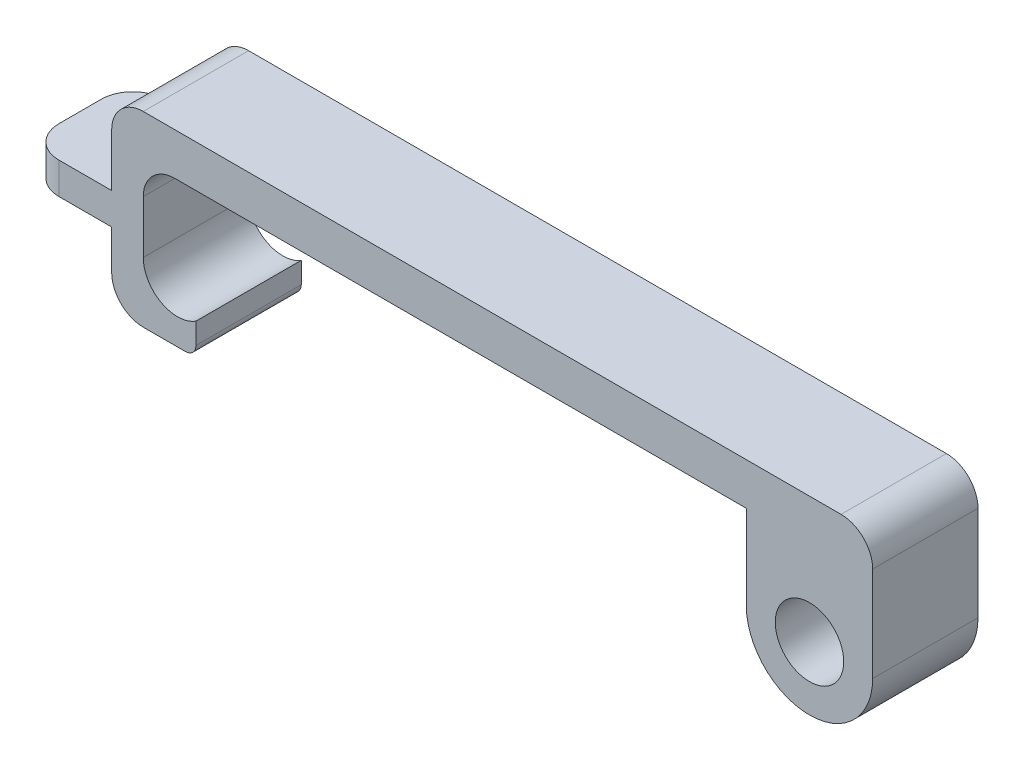
ISO-10303-21;
HEADER;
FILE_DESCRIPTION(('STEP AP214'),'2;1');
FILE_NAME('part.step','',(''),(''),'','','');
FILE_SCHEMA(('AUTOMOTIVE_DESIGN { 1 0 10303 214 1 1 1 1 }'));
ENDSEC;
DATA;
#1=APPLICATION_CONTEXT('core data for automotive mechanical design processes');
#2=APPLICATION_PROTOCOL_DEFINITION('international standard','automotive_design',2000,#1);
#3=PRODUCT_CONTEXT('',#1,'mechanical');
#4=PRODUCT('Part','Part','',(#3));
#5=PRODUCT_RELATED_PRODUCT_CATEGORY('part','',(#4));
#6=PRODUCT_DEFINITION_FORMATION('','',#4);
#7=PRODUCT_DEFINITION_CONTEXT('part definition',#1,'design');
#8=PRODUCT_DEFINITION('design','',#6,#7);
#9=PRODUCT_DEFINITION_SHAPE('','',#8);
#10=(LENGTH_UNIT() NAMED_UNIT(*) SI_UNIT(.MILLI.,.METRE.));
#11=(NAMED_UNIT(*) PLANE_ANGLE_UNIT() SI_UNIT($,.RADIAN.));
#12=(NAMED_UNIT(*) SI_UNIT($,.STERADIAN.) SOLID_ANGLE_UNIT());
#13=UNCERTAINTY_MEASURE_WITH_UNIT(LENGTH_MEASURE(1.E-05),#10,'distance_accuracy_value','');
#14=(GEOMETRIC_REPRESENTATION_CONTEXT(3) GLOBAL_UNCERTAINTY_ASSIGNED_CONTEXT((#13)) GLOBAL_UNIT_ASSIGNED_CONTEXT((#10,
#11,#12)) REPRESENTATION_CONTEXT('',''));
#15=CARTESIAN_POINT('',(0.,0.,0.));
#16=DIRECTION('',(0.,0.,1.));
#17=DIRECTION('',(1.,0.,0.));
#18=AXIS2_PLACEMENT_3D('',#15,#16,#17);
#19=CARTESIAN_POINT('',(-42.4115968956036,18.9102108321819,10.));
#20=DIRECTION('',(0.,0.,1.));
#21=DIRECTION('',(1.,0.,0.));
#22=AXIS2_PLACEMENT_3D('',#19,#20,#21);
#23=PLANE('',#22);
#24=DIRECTION('',(1.,0.,0.));
#25=VECTOR('',#24,1.);
#26=CARTESIAN_POINT('',(-40.6615968956036,13.1715980446561,10.));
#27=LINE('',#26,#25);
#28=CARTESIAN_POINT('',(-45.6615968956036,13.1715980446561,10.));
#29=VERTEX_POINT('',#28);
#30=CARTESIAN_POINT('',(-41.6615968956036,13.1715980446561,10.));
#31=VERTEX_POINT('',#30);
#32=EDGE_CURVE('E207',#29,#31,#27,.T.);
#33=ORIENTED_EDGE('',*,*,#32,.T.);
#34=CARTESIAN_POINT('',(-41.6615968956036,14.1715980446561,10.));
#35=DIRECTION('',(0.,0.,1.));
#36=DIRECTION('',(1.,0.,0.));
#37=AXIS2_PLACEMENT_3D('',#34,#35,#36);
#38=CIRCLE('',#37,1.);
#39=CARTESIAN_POINT('',(-40.6615968956036,14.1715980446561,10.));
#40=VERTEX_POINT('',#39);
#41=EDGE_CURVE('E11',#31,#40,#38,.T.);
#42=ORIENTED_EDGE('',*,*,#41,.T.);
#43=DIRECTION('',(0.,1.,0.));
#44=VECTOR('',#43,1.);
#45=CARTESIAN_POINT('',(-40.6615968956036,16.1715980446561,10.));
#46=LINE('',#45,#44);
#47=CARTESIAN_POINT('',(-40.6615968956036,16.1715980446561,10.));
#48=VERTEX_POINT('',#47);
#49=EDGE_CURVE('E209',#40,#48,#46,.T.);
#50=ORIENTED_EDGE('',*,*,#49,.T.);
#51=CARTESIAN_POINT('',(-42.4115968956036,18.9102108321819,10.));
#52=DIRECTION('',(0.,0.,-1.));
#53=DIRECTION('',(1.,0.,0.));
#54=AXIS2_PLACEMENT_3D('',#51,#52,#53);
#55=CIRCLE('',#54,3.25);
#56=CARTESIAN_POINT('',(-45.6615968956036,18.9102108321819,10.));
#57=VERTEX_POINT('',#56);
#58=EDGE_CURVE('E214',#48,#57,#55,.T.);
#59=ORIENTED_EDGE('',*,*,#58,.T.);
#60=DIRECTION('',(0.,1.,0.));
#61=VECTOR('',#60,1.);
#62=CARTESIAN_POINT('',(-45.6615968956036,26.9102108321804,10.));
#63=LINE('',#62,#61);
#64=CARTESIAN_POINT('',(-45.6615968956036,23.9102108321804,10.));
#65=VERTEX_POINT('',#64);
#66=EDGE_CURVE('E216',#57,#65,#63,.T.);
#67=ORIENTED_EDGE('',*,*,#66,.T.);
#68=CARTESIAN_POINT('',(-42.6615968956036,23.9102108321804,10.));
#69=DIRECTION('',(0.,0.,1.));
#70=DIRECTION('',(1.,0.,0.));
#71=AXIS2_PLACEMENT_3D('',#68,#69,#70);
#72=CIRCLE('',#71,3.);
#73=CARTESIAN_POINT('',(-42.6615968956036,26.9102108321804,10.));
#74=VERTEX_POINT('',#73);
#75=EDGE_CURVE('E334',#65,#74,#72,.F.);
#76=ORIENTED_EDGE('',*,*,#75,.T.);
#77=DIRECTION('',(1.,0.,0.));
#78=VECTOR('',#77,1.);
#79=CARTESIAN_POINT('',(11.5884031043968,26.9102108321804,10.));
#80=LINE('',#79,#78);
#81=CARTESIAN_POINT('',(11.5884031043968,26.9102108321804,10.));
#82=VERTEX_POINT('',#81);
#83=EDGE_CURVE('E219',#74,#82,#80,.T.);
#84=ORIENTED_EDGE('',*,*,#83,.T.);
#85=DIRECTION('',(0.,-1.,0.));
#86=VECTOR('',#85,1.);
#87=CARTESIAN_POINT('',(11.5884031043968,18.9102108321817,10.));
#88=LINE('',#87,#86);
#89=CARTESIAN_POINT('',(11.5884031043968,18.9102108321817,10.));
#90=VERTEX_POINT('',#89);
#91=EDGE_CURVE('E221',#82,#90,#88,.T.);
#92=ORIENTED_EDGE('',*,*,#91,.T.);
#93=CARTESIAN_POINT('',(17.5884031043968,18.9102108321817,10.));
#94=DIRECTION('',(0.,0.,1.));
#95=DIRECTION('',(1.,0.,0.));
#96=AXIS2_PLACEMENT_3D('',#93,#94,#95);
#97=CIRCLE('',#96,6.);
#98=CARTESIAN_POINT('',(23.5884031043968,18.9102108321817,10.));
#99=VERTEX_POINT('',#98);
#100=EDGE_CURVE('E223',#90,#99,#97,.T.);
#101=ORIENTED_EDGE('',*,*,#100,.T.);
#102=DIRECTION('',(0.,1.,0.));
#103=VECTOR('',#102,1.);
#104=CARTESIAN_POINT('',(23.5884031043968,30.9102108321804,10.));
#105=LINE('',#104,#103);
#106=CARTESIAN_POINT('',(23.5884031043968,27.9102108321804,10.));
#107=VERTEX_POINT('',#106);
#108=EDGE_CURVE('E225',#99,#107,#105,.T.);
#109=ORIENTED_EDGE('',*,*,#108,.T.);
#110=CARTESIAN_POINT('',(20.5884031043968,27.9102108321804,10.));
#111=DIRECTION('',(0.,0.,1.));
#112=DIRECTION('',(1.,0.,0.));
#113=AXIS2_PLACEMENT_3D('',#110,#111,#112);
#114=CIRCLE('',#113,3.);
#115=CARTESIAN_POINT('',(20.5884031043968,30.9102108321804,10.));
#116=VERTEX_POINT('',#115);
#117=EDGE_CURVE('E285',#107,#116,#114,.T.);
#118=ORIENTED_EDGE('',*,*,#117,.T.);
#119=DIRECTION('',(-1.,0.,0.));
#120=VECTOR('',#119,1.);
#121=CARTESIAN_POINT('',(-48.6615968956036,30.9102108321804,10.));
#122=LINE('',#121,#120);
#123=CARTESIAN_POINT('',(-45.6615968956036,30.9102108321804,10.));
#124=VERTEX_POINT('',#123);
#125=EDGE_CURVE('E228',#116,#124,#122,.T.);
#126=ORIENTED_EDGE('',*,*,#125,.T.);
#127=CARTESIAN_POINT('',(-45.6615968956036,27.9102108321804,10.));
#128=DIRECTION('',(0.,0.,1.));
#129=DIRECTION('',(1.,0.,0.));
#130=AXIS2_PLACEMENT_3D('',#127,#128,#129);
#131=CIRCLE('',#130,3.);
#132=CARTESIAN_POINT('',(-48.6615968956036,27.9102108321804,10.));
#133=VERTEX_POINT('',#132);
#134=EDGE_CURVE('E289',#124,#133,#131,.T.);
#135=ORIENTED_EDGE('',*,*,#134,.T.);
#136=DIRECTION('',(0.,-1.,0.));
#137=VECTOR('',#136,1.);
#138=CARTESIAN_POINT('',(-48.6615968956036,22.9102108321804,10.));
#139=LINE('',#138,#137);
#140=CARTESIAN_POINT('',(-48.6615968956036,22.9102108321804,10.));
#141=VERTEX_POINT('',#140);
#142=EDGE_CURVE('E231',#133,#141,#139,.T.);
#143=ORIENTED_EDGE('',*,*,#142,.T.);
#144=DIRECTION('',(-1.,0.,0.));
#145=VECTOR('',#144,1.);
#146=CARTESIAN_POINT('',(-48.6615968956036,22.9102108321804,10.));
#147=LINE('',#146,#145);
#148=CARTESIAN_POINT('',(-53.6615968956036,22.9102108321804,10.));
#149=VERTEX_POINT('',#148);
#150=EDGE_CURVE('E191',#141,#149,#147,.T.);
#151=ORIENTED_EDGE('',*,*,#150,.T.);
#152=DIRECTION('',(0.,-1.,0.));
#153=VECTOR('',#152,1.);
#154=CARTESIAN_POINT('',(-53.6615968956036,19.9102108321804,10.));
#155=LINE('',#154,#153);
#156=CARTESIAN_POINT('',(-53.6615968956036,19.9102108321804,10.));
#157=VERTEX_POINT('',#156);
#158=EDGE_CURVE('E189',#149,#157,#155,.T.);
#159=ORIENTED_EDGE('',*,*,#158,.T.);
#160=DIRECTION('',(1.,0.,0.));
#161=VECTOR('',#160,1.);
#162=CARTESIAN_POINT('',(-48.6615968956036,19.9102108321804,10.));
#163=LINE('',#162,#161);
#164=CARTESIAN_POINT('',(-48.6615968956036,19.9102108321804,10.));
#165=VERTEX_POINT('',#164);
#166=EDGE_CURVE('E181',#157,#165,#163,.T.);
#167=ORIENTED_EDGE('',*,*,#166,.T.);
#168=DIRECTION('',(0.,-1.,0.));
#169=VECTOR('',#168,1.);
#170=CARTESIAN_POINT('',(-48.6615968956036,13.1715980446561,10.));
#171=LINE('',#170,#169);
#172=CARTESIAN_POINT('',(-48.6615968956036,16.1715980446561,10.));
#173=VERTEX_POINT('',#172);
#174=EDGE_CURVE('E185',#165,#173,#171,.T.);
#175=ORIENTED_EDGE('',*,*,#174,.T.);
#176=CARTESIAN_POINT('',(-45.6615968956036,16.1715980446561,10.));
#177=DIRECTION('',(0.,0.,1.));
#178=DIRECTION('',(1.,0.,0.));
#179=AXIS2_PLACEMENT_3D('',#176,#177,#178);
#180=CIRCLE('',#179,3.);
#181=EDGE_CURVE('E287',#173,#29,#180,.T.);
#182=ORIENTED_EDGE('',*,*,#181,.T.);
#183=EDGE_LOOP('',(#33,#42,#50,#59,#67,#76,#84,#92,#101,#109,#118,#126,#135,#143,#151,#159,#167,
#175,#182));
#184=FACE_BOUND('',#183,.T.);
#185=CARTESIAN_POINT('',(17.5884031043968,18.9102108321817,10.));
#186=DIRECTION('',(0.,0.,1.));
#187=DIRECTION('',(1.,0.,0.));
#188=AXIS2_PLACEMENT_3D('',#185,#186,#187);
#189=CIRCLE('',#188,3.25);
#190=CARTESIAN_POINT('',(20.8384031043968,18.9102108321817,10.));
#191=VERTEX_POINT('',#190);
#192=EDGE_CURVE('E237',#191,#191,#189,.T.);
#193=ORIENTED_EDGE('',*,*,#192,.F.);
#194=EDGE_LOOP('',(#193));
#195=FACE_BOUND('',#194,.T.);
#196=ADVANCED_FACE('F37',(#184,#195),#23,.T.);
#197=CARTESIAN_POINT('',(-42.4115968956036,18.9102108321819,0.));
#198=DIRECTION('',(0.,0.,1.));
#199=DIRECTION('',(1.,0.,0.));
#200=AXIS2_PLACEMENT_3D('',#197,#198,#199);
#201=PLANE('',#200);
#202=DIRECTION('',(0.,1.,0.));
#203=VECTOR('',#202,1.);
#204=CARTESIAN_POINT('',(-40.6615968956036,16.1715980446561,0.));
#205=LINE('',#204,#203);
#206=CARTESIAN_POINT('',(-40.6615968956036,14.1715980446561,0.));
#207=VERTEX_POINT('',#206);
#208=CARTESIAN_POINT('',(-40.6615968956036,16.1715980446561,0.));
#209=VERTEX_POINT('',#208);
#210=EDGE_CURVE('E243',#207,#209,#205,.T.);
#211=ORIENTED_EDGE('',*,*,#210,.F.);
#212=CARTESIAN_POINT('',(-41.6615968956036,14.1715980446561,0.));
#213=DIRECTION('',(0.,0.,1.));
#214=DIRECTION('',(1.,0.,0.));
#215=AXIS2_PLACEMENT_3D('',#212,#213,#214);
#216=CIRCLE('',#215,1.);
#217=CARTESIAN_POINT('',(-41.6615968956036,13.1715980446561,0.));
#218=VERTEX_POINT('',#217);
#219=EDGE_CURVE('E59',#207,#218,#216,.F.);
#220=ORIENTED_EDGE('',*,*,#219,.T.);
#221=DIRECTION('',(1.,0.,0.));
#222=VECTOR('',#221,1.);
#223=CARTESIAN_POINT('',(-40.6615968956036,13.1715980446561,0.));
#224=LINE('',#223,#222);
#225=CARTESIAN_POINT('',(-45.6615968956036,13.1715980446561,0.));
#226=VERTEX_POINT('',#225);
#227=EDGE_CURVE('E241',#226,#218,#224,.T.);
#228=ORIENTED_EDGE('',*,*,#227,.F.);
#229=CARTESIAN_POINT('',(-45.6615968956036,16.1715980446561,0.));
#230=DIRECTION('',(0.,0.,1.));
#231=DIRECTION('',(1.,0.,0.));
#232=AXIS2_PLACEMENT_3D('',#229,#230,#231);
#233=CIRCLE('',#232,3.);
#234=CARTESIAN_POINT('',(-48.6615968956036,16.1715980446561,0.));
#235=VERTEX_POINT('',#234);
#236=EDGE_CURVE('E307',#226,#235,#233,.F.);
#237=ORIENTED_EDGE('',*,*,#236,.T.);
#238=DIRECTION('',(0.,-1.,0.));
#239=VECTOR('',#238,1.);
#240=CARTESIAN_POINT('',(-48.6615968956036,13.1715980446561,0.));
#241=LINE('',#240,#239);
#242=CARTESIAN_POINT('',(-48.6615968956036,19.9102108321804,0.));
#243=VERTEX_POINT('',#242);
#244=EDGE_CURVE('E239',#243,#235,#241,.T.);
#245=ORIENTED_EDGE('',*,*,#244,.F.);
#246=DIRECTION('',(1.,0.,0.));
#247=VECTOR('',#246,1.);
#248=CARTESIAN_POINT('',(-48.6615968956036,19.9102108321804,0.));
#249=LINE('',#248,#247);
#250=CARTESIAN_POINT('',(-53.6615968956036,19.9102108321804,0.));
#251=VERTEX_POINT('',#250);
#252=EDGE_CURVE('E197',#251,#243,#249,.T.);
#253=ORIENTED_EDGE('',*,*,#252,.F.);
#254=DIRECTION('',(0.,-1.,0.));
#255=VECTOR('',#254,1.);
#256=CARTESIAN_POINT('',(-53.6615968956036,18.910210832182,0.));
#257=LINE('',#256,#255);
#258=CARTESIAN_POINT('',(-53.6615968956036,22.9102108321804,0.));
#259=VERTEX_POINT('',#258);
#260=EDGE_CURVE('E311',#251,#259,#257,.F.);
#261=ORIENTED_EDGE('',*,*,#260,.T.);
#262=DIRECTION('',(-1.,0.,0.));
#263=VECTOR('',#262,1.);
#264=CARTESIAN_POINT('',(-48.6615968956036,22.9102108321804,0.));
#265=LINE('',#264,#263);
#266=CARTESIAN_POINT('',(-48.6615968956036,22.9102108321804,0.));
#267=VERTEX_POINT('',#266);
#268=EDGE_CURVE('E234',#267,#259,#265,.T.);
#269=ORIENTED_EDGE('',*,*,#268,.F.);
#270=DIRECTION('',(0.,-1.,0.));
#271=VECTOR('',#270,1.);
#272=CARTESIAN_POINT('',(-48.6615968956036,22.9102108321804,0.));
#273=LINE('',#272,#271);
#274=CARTESIAN_POINT('',(-48.6615968956036,27.9102108321804,0.));
#275=VERTEX_POINT('',#274);
#276=EDGE_CURVE('E262',#275,#267,#273,.T.);
#277=ORIENTED_EDGE('',*,*,#276,.F.);
#278=CARTESIAN_POINT('',(-45.6615968956036,27.9102108321804,0.));
#279=DIRECTION('',(0.,0.,1.));
#280=DIRECTION('',(1.,0.,0.));
#281=AXIS2_PLACEMENT_3D('',#278,#279,#280);
#282=CIRCLE('',#281,3.);
#283=CARTESIAN_POINT('',(-45.6615968956036,30.9102108321804,0.));
#284=VERTEX_POINT('',#283);
#285=EDGE_CURVE('E309',#275,#284,#282,.F.);
#286=ORIENTED_EDGE('',*,*,#285,.T.);
#287=DIRECTION('',(-1.,0.,0.));
#288=VECTOR('',#287,1.);
#289=CARTESIAN_POINT('',(-48.6615968956036,30.9102108321804,0.));
#290=LINE('',#289,#288);
#291=CARTESIAN_POINT('',(20.5884031043968,30.9102108321804,0.));
#292=VERTEX_POINT('',#291);
#293=EDGE_CURVE('E259',#292,#284,#290,.T.);
#294=ORIENTED_EDGE('',*,*,#293,.F.);
#295=CARTESIAN_POINT('',(20.5884031043968,27.9102108321804,0.));
#296=DIRECTION('',(0.,0.,1.));
#297=DIRECTION('',(1.,0.,0.));
#298=AXIS2_PLACEMENT_3D('',#295,#296,#297);
#299=CIRCLE('',#298,3.);
#300=CARTESIAN_POINT('',(23.5884031043968,27.9102108321804,0.));
#301=VERTEX_POINT('',#300);
#302=EDGE_CURVE('E305',#292,#301,#299,.F.);
#303=ORIENTED_EDGE('',*,*,#302,.T.);
#304=DIRECTION('',(0.,1.,0.));
#305=VECTOR('',#304,1.);
#306=CARTESIAN_POINT('',(23.5884031043968,30.9102108321804,0.));
#307=LINE('',#306,#305);
#308=CARTESIAN_POINT('',(23.5884031043968,18.9102108321817,0.));
#309=VERTEX_POINT('',#308);
#310=EDGE_CURVE('E256',#309,#301,#307,.T.);
#311=ORIENTED_EDGE('',*,*,#310,.F.);
#312=CARTESIAN_POINT('',(17.5884031043968,18.9102108321817,0.));
#313=DIRECTION('',(0.,0.,1.));
#314=DIRECTION('',(1.,0.,0.));
#315=AXIS2_PLACEMENT_3D('',#312,#313,#314);
#316=CIRCLE('',#315,6.);
#317=CARTESIAN_POINT('',(11.5884031043968,18.9102108321817,0.));
#318=VERTEX_POINT('',#317);
#319=EDGE_CURVE('E254',#318,#309,#316,.T.);
#320=ORIENTED_EDGE('',*,*,#319,.F.);
#321=DIRECTION('',(0.,-1.,0.));
#322=VECTOR('',#321,1.);
#323=CARTESIAN_POINT('',(11.5884031043968,18.9102108321817,0.));
#324=LINE('',#323,#322);
#325=CARTESIAN_POINT('',(11.5884031043968,26.9102108321804,0.));
#326=VERTEX_POINT('',#325);
#327=EDGE_CURVE('E252',#326,#318,#324,.T.);
#328=ORIENTED_EDGE('',*,*,#327,.F.);
#329=DIRECTION('',(1.,0.,0.));
#330=VECTOR('',#329,1.);
#331=CARTESIAN_POINT('',(11.5884031043968,26.9102108321804,0.));
#332=LINE('',#331,#330);
#333=CARTESIAN_POINT('',(-42.6615968956036,26.9102108321804,0.));
#334=VERTEX_POINT('',#333);
#335=EDGE_CURVE('E250',#334,#326,#332,.T.);
#336=ORIENTED_EDGE('',*,*,#335,.F.);
#337=CARTESIAN_POINT('',(-42.6615968956036,23.9102108321804,0.));
#338=DIRECTION('',(0.,0.,1.));
#339=DIRECTION('',(1.,0.,0.));
#340=AXIS2_PLACEMENT_3D('',#337,#338,#339);
#341=CIRCLE('',#340,3.);
#342=CARTESIAN_POINT('',(-45.6615968956036,23.9102108321804,0.));
#343=VERTEX_POINT('',#342);
#344=EDGE_CURVE('E332',#334,#343,#341,.T.);
#345=ORIENTED_EDGE('',*,*,#344,.T.);
#346=DIRECTION('',(0.,1.,0.));
#347=VECTOR('',#346,1.);
#348=CARTESIAN_POINT('',(-45.6615968956036,26.9102108321804,0.));
#349=LINE('',#348,#347);
#350=CARTESIAN_POINT('',(-45.6615968956036,18.9102108321819,0.));
#351=VERTEX_POINT('',#350);
#352=EDGE_CURVE('E247',#351,#343,#349,.T.);
#353=ORIENTED_EDGE('',*,*,#352,.F.);
#354=CARTESIAN_POINT('',(-42.4115968956036,18.9102108321819,0.));
#355=DIRECTION('',(0.,0.,-1.));
#356=DIRECTION('',(1.,0.,0.));
#357=AXIS2_PLACEMENT_3D('',#354,#355,#356);
#358=CIRCLE('',#357,3.25);
#359=EDGE_CURVE('E245',#209,#351,#358,.T.);
#360=ORIENTED_EDGE('',*,*,#359,.F.);
#361=EDGE_LOOP('',(#211,#220,#228,#237,#245,#253,#261,#269,#277,#286,#294,#303,#311,#320,#328,
#336,#345,#353,#360));
#362=FACE_BOUND('',#361,.T.);
#363=CARTESIAN_POINT('',(17.5884031043968,18.9102108321817,0.));
#364=DIRECTION('',(0.,0.,1.));
#365=DIRECTION('',(1.,0.,0.));
#366=AXIS2_PLACEMENT_3D('',#363,#364,#365);
#367=CIRCLE('',#366,3.25);
#368=CARTESIAN_POINT('',(20.8384031043968,18.9102108321817,0.));
#369=VERTEX_POINT('',#368);
#370=EDGE_CURVE('E666',#369,#369,#367,.T.);
#371=ORIENTED_EDGE('',*,*,#370,.T.);
#372=EDGE_LOOP('',(#371));
#373=FACE_BOUND('',#372,.T.);
#374=ADVANCED_FACE('F347',(#362,#373),#201,.F.);
#375=CARTESIAN_POINT('',(-48.6615968956036,22.9102108321804,10.));
#376=DIRECTION('',(0.,-1.,0.));
#377=DIRECTION('',(0.,0.,-1.));
#378=AXIS2_PLACEMENT_3D('',#375,#376,#377);
#379=PLANE('',#378);
#380=DIRECTION('',(0.,0.,-1.));
#381=VECTOR('',#380,1.);
#382=CARTESIAN_POINT('',(-56.6615968956036,22.9102108321804,10.));
#383=LINE('',#382,#381);
#384=CARTESIAN_POINT('',(-56.6615968956036,22.9102108321804,7.));
#385=VERTEX_POINT('',#384);
#386=CARTESIAN_POINT('',(-56.6615968956036,22.9102108321804,3.));
#387=VERTEX_POINT('',#386);
#388=EDGE_CURVE('E282',#385,#387,#383,.T.);
#389=ORIENTED_EDGE('',*,*,#388,.F.);
#390=CARTESIAN_POINT('',(-53.6615968956036,22.9102108321804,7.));
#391=DIRECTION('',(0.,-1.,0.));
#392=DIRECTION('',(0.,0.,-1.));
#393=AXIS2_PLACEMENT_3D('',#390,#391,#392);
#394=CIRCLE('',#393,3.);
#395=EDGE_CURVE('E303',#385,#149,#394,.F.);
#396=ORIENTED_EDGE('',*,*,#395,.T.);
#397=ORIENTED_EDGE('',*,*,#150,.F.);
#398=DIRECTION('',(0.,0.,-1.));
#399=VECTOR('',#398,1.);
#400=CARTESIAN_POINT('',(-48.6615968956036,22.9102108321804,10.));
#401=LINE('',#400,#399);
#402=EDGE_CURVE('E233',#141,#267,#401,.T.);
#403=ORIENTED_EDGE('',*,*,#402,.T.);
#404=ORIENTED_EDGE('',*,*,#268,.T.);
#405=CARTESIAN_POINT('',(-53.6615968956036,22.9102108321804,3.));
#406=DIRECTION('',(0.,-1.,0.));
#407=DIRECTION('',(0.,0.,-1.));
#408=AXIS2_PLACEMENT_3D('',#405,#406,#407);
#409=CIRCLE('',#408,3.);
#410=EDGE_CURVE('E301',#259,#387,#409,.F.);
#411=ORIENTED_EDGE('',*,*,#410,.T.);
#412=EDGE_LOOP('',(#389,#396,#397,#403,#404,#411));
#413=FACE_BOUND('',#412,.T.);
#414=ADVANCED_FACE('F428',(#413),#379,.F.);
#415=CARTESIAN_POINT('',(-56.6615968956036,22.9102108321804,10.));
#416=DIRECTION('',(1.,0.,0.));
#417=DIRECTION('',(0.,1.,0.));
#418=AXIS2_PLACEMENT_3D('',#415,#416,#417);
#419=PLANE('',#418);
#420=DIRECTION('',(0.,0.,-1.));
#421=VECTOR('',#420,1.);
#422=CARTESIAN_POINT('',(-56.6615968956036,19.9102108321804,10.));
#423=LINE('',#422,#421);
#424=CARTESIAN_POINT('',(-56.6615968956036,19.9102108321804,7.));
#425=VERTEX_POINT('',#424);
#426=CARTESIAN_POINT('',(-56.6615968956036,19.9102108321804,3.));
#427=VERTEX_POINT('',#426);
#428=EDGE_CURVE('E201',#425,#427,#423,.T.);
#429=ORIENTED_EDGE('',*,*,#428,.F.);
#430=DIRECTION('',(0.,-1.,0.));
#431=VECTOR('',#430,1.);
#432=CARTESIAN_POINT('',(-56.6615968956036,22.9102108321804,7.));
#433=LINE('',#432,#431);
#434=EDGE_CURVE('E299',#425,#385,#433,.F.);
#435=ORIENTED_EDGE('',*,*,#434,.T.);
#436=ORIENTED_EDGE('',*,*,#388,.T.);
#437=DIRECTION('',(0.,-1.,0.));
#438=VECTOR('',#437,1.);
#439=CARTESIAN_POINT('',(-56.6615968956036,22.9102108321804,3.));
#440=LINE('',#439,#438);
#441=EDGE_CURVE('E296',#387,#427,#440,.T.);
#442=ORIENTED_EDGE('',*,*,#441,.T.);
#443=EDGE_LOOP('',(#429,#435,#436,#442));
#444=FACE_BOUND('',#443,.T.);
#445=ADVANCED_FACE('F408',(#444),#419,.F.);
#446=CARTESIAN_POINT('',(-48.6615968956036,19.9102108321804,10.));
#447=DIRECTION('',(0.,1.,0.));
#448=DIRECTION('',(-1.,0.,0.));
#449=AXIS2_PLACEMENT_3D('',#446,#447,#448);
#450=PLANE('',#449);
#451=ORIENTED_EDGE('',*,*,#166,.F.);
#452=CARTESIAN_POINT('',(-53.6615968956036,19.9102108321804,7.));
#453=DIRECTION('',(0.,1.,0.));
#454=DIRECTION('',(-1.,0.,0.));
#455=AXIS2_PLACEMENT_3D('',#452,#453,#454);
#456=CIRCLE('',#455,3.);
#457=EDGE_CURVE('E294',#157,#425,#456,.F.);
#458=ORIENTED_EDGE('',*,*,#457,.T.);
#459=ORIENTED_EDGE('',*,*,#428,.T.);
#460=CARTESIAN_POINT('',(-53.6615968956036,19.9102108321804,3.));
#461=DIRECTION('',(0.,1.,0.));
#462=DIRECTION('',(-1.,0.,0.));
#463=AXIS2_PLACEMENT_3D('',#460,#461,#462);
#464=CIRCLE('',#463,3.);
#465=EDGE_CURVE('E292',#427,#251,#464,.F.);
#466=ORIENTED_EDGE('',*,*,#465,.T.);
#467=ORIENTED_EDGE('',*,*,#252,.T.);
#468=DIRECTION('',(0.,0.,-1.));
#469=VECTOR('',#468,1.);
#470=CARTESIAN_POINT('',(-48.6615968956036,19.9102108321804,10.));
#471=LINE('',#470,#469);
#472=EDGE_CURVE('E194',#165,#243,#471,.T.);
#473=ORIENTED_EDGE('',*,*,#472,.F.);
#474=EDGE_LOOP('',(#451,#458,#459,#466,#467,#473));
#475=FACE_BOUND('',#474,.T.);
#476=ADVANCED_FACE('F195',(#475),#450,.F.);
#477=CARTESIAN_POINT('',(-48.6615968956036,13.1715980446561,10.));
#478=DIRECTION('',(1.,0.,0.));
#479=DIRECTION('',(0.,1.,0.));
#480=AXIS2_PLACEMENT_3D('',#477,#478,#479);
#481=PLANE('',#480);
#482=ORIENTED_EDGE('',*,*,#244,.T.);
#483=DIRECTION('',(0.,0.,-1.));
#484=VECTOR('',#483,1.);
#485=CARTESIAN_POINT('',(-48.6615968956036,16.1715980446561,10.));
#486=LINE('',#485,#484);
#487=EDGE_CURVE('E206',#235,#173,#486,.F.);
#488=ORIENTED_EDGE('',*,*,#487,.T.);
#489=ORIENTED_EDGE('',*,*,#174,.F.);
#490=ORIENTED_EDGE('',*,*,#472,.T.);
#491=EDGE_LOOP('',(#482,#488,#489,#490));
#492=FACE_BOUND('',#491,.T.);
#493=ADVANCED_FACE('F204',(#492),#481,.F.);
#494=CARTESIAN_POINT('',(-40.6615968956036,13.1715980446561,10.));
#495=DIRECTION('',(0.,1.,0.));
#496=DIRECTION('',(-1.,0.,0.));
#497=AXIS2_PLACEMENT_3D('',#494,#495,#496);
#498=PLANE('',#497);
#499=ORIENTED_EDGE('',*,*,#227,.T.);
#500=DIRECTION('',(0.,0.,-1.));
#501=VECTOR('',#500,1.);
#502=CARTESIAN_POINT('',(-41.6615968956036,13.1715980446561,10.));
#503=LINE('',#502,#501);
#504=EDGE_CURVE('E45',#218,#31,#503,.F.);
#505=ORIENTED_EDGE('',*,*,#504,.T.);
#506=ORIENTED_EDGE('',*,*,#32,.F.);
#507=DIRECTION('',(0.,0.,-1.));
#508=VECTOR('',#507,1.);
#509=CARTESIAN_POINT('',(-45.6615968956036,13.1715980446561,10.));
#510=LINE('',#509,#508);
#511=EDGE_CURVE('E326',#29,#226,#510,.T.);
#512=ORIENTED_EDGE('',*,*,#511,.T.);
#513=EDGE_LOOP('',(#499,#505,#506,#512));
#514=FACE_BOUND('',#513,.T.);
#515=ADVANCED_FACE('F418',(#514),#498,.F.);
#516=CARTESIAN_POINT('',(-40.6615968956036,16.1715980446561,10.));
#517=DIRECTION('',(-1.,0.,0.));
#518=DIRECTION('',(0.,0.,1.));
#519=AXIS2_PLACEMENT_3D('',#516,#517,#518);
#520=PLANE('',#519);
#521=ORIENTED_EDGE('',*,*,#49,.F.);
#522=DIRECTION('',(0.,0.,-1.));
#523=VECTOR('',#522,1.);
#524=CARTESIAN_POINT('',(-40.6615968956036,14.1715980446561,10.));
#525=LINE('',#524,#523);
#526=EDGE_CURVE('E336',#40,#207,#525,.T.);
#527=ORIENTED_EDGE('',*,*,#526,.T.);
#528=ORIENTED_EDGE('',*,*,#210,.T.);
#529=DIRECTION('',(0.,0.,-1.));
#530=VECTOR('',#529,1.);
#531=CARTESIAN_POINT('',(-40.6615968956036,16.1715980446561,10.));
#532=LINE('',#531,#530);
#533=EDGE_CURVE('E202',#48,#209,#532,.T.);
#534=ORIENTED_EDGE('',*,*,#533,.F.);
#535=EDGE_LOOP('',(#521,#527,#528,#534));
#536=FACE_BOUND('',#535,.T.);
#537=ADVANCED_FACE('F342',(#536),#520,.F.);
#538=CARTESIAN_POINT('',(-42.4115968956036,18.9102108321819,10.));
#539=DIRECTION('',(0.,0.,-1.));
#540=DIRECTION('',(-1.,0.,0.));
#541=AXIS2_PLACEMENT_3D('',#538,#539,#540);
#542=CYLINDRICAL_SURFACE('',#541,3.25);
#543=ORIENTED_EDGE('',*,*,#359,.T.);
#544=DIRECTION('',(0.,0.,-1.));
#545=VECTOR('',#544,1.);
#546=CARTESIAN_POINT('',(-45.6615968956036,18.9102108321819,10.));
#547=LINE('',#546,#545);
#548=EDGE_CURVE('E275',#57,#351,#547,.T.);
#549=ORIENTED_EDGE('',*,*,#548,.F.);
#550=ORIENTED_EDGE('',*,*,#58,.F.);
#551=ORIENTED_EDGE('',*,*,#533,.T.);
#552=EDGE_LOOP('',(#543,#549,#550,#551));
#553=FACE_BOUND('',#552,.T.);
#554=ADVANCED_FACE('F352',(#553),#542,.F.);
#555=CARTESIAN_POINT('',(-45.6615968956036,26.9102108321804,10.));
#556=DIRECTION('',(-1.,0.,0.));
#557=DIRECTION('',(0.,0.,1.));
#558=AXIS2_PLACEMENT_3D('',#555,#556,#557);
#559=PLANE('',#558);
#560=ORIENTED_EDGE('',*,*,#352,.T.);
#561=DIRECTION('',(0.,0.,-1.));
#562=VECTOR('',#561,1.);
#563=CARTESIAN_POINT('',(-45.6615968956036,23.9102108321804,10.));
#564=LINE('',#563,#562);
#565=EDGE_CURVE('E324',#343,#65,#564,.F.);
#566=ORIENTED_EDGE('',*,*,#565,.T.);
#567=ORIENTED_EDGE('',*,*,#66,.F.);
#568=ORIENTED_EDGE('',*,*,#548,.T.);
#569=EDGE_LOOP('',(#560,#566,#567,#568));
#570=FACE_BOUND('',#569,.T.);
#571=ADVANCED_FACE('F356',(#570),#559,.F.);
#572=CARTESIAN_POINT('',(11.5884031043968,26.9102108321804,10.));
#573=DIRECTION('',(0.,1.,0.));
#574=DIRECTION('',(-1.,0.,0.));
#575=AXIS2_PLACEMENT_3D('',#572,#573,#574);
#576=PLANE('',#575);
#577=ORIENTED_EDGE('',*,*,#83,.F.);
#578=DIRECTION('',(0.,0.,-1.));
#579=VECTOR('',#578,1.);
#580=CARTESIAN_POINT('',(-42.6615968956036,26.9102108321804,0.));
#581=LINE('',#580,#579);
#582=EDGE_CURVE('E321',#74,#334,#581,.T.);
#583=ORIENTED_EDGE('',*,*,#582,.T.);
#584=ORIENTED_EDGE('',*,*,#335,.T.);
#585=DIRECTION('',(0.,0.,-1.));
#586=VECTOR('',#585,1.);
#587=CARTESIAN_POINT('',(11.5884031043968,26.9102108321804,10.));
#588=LINE('',#587,#586);
#589=EDGE_CURVE('E272',#82,#326,#588,.T.);
#590=ORIENTED_EDGE('',*,*,#589,.F.);
#591=EDGE_LOOP('',(#577,#583,#584,#590));
#592=FACE_BOUND('',#591,.T.);
#593=ADVANCED_FACE('F365',(#592),#576,.F.);
#594=CARTESIAN_POINT('',(11.5884031043968,18.9102108321817,10.));
#595=DIRECTION('',(1.,0.,0.));
#596=DIRECTION('',(0.,0.,-1.));
#597=AXIS2_PLACEMENT_3D('',#594,#595,#596);
#598=PLANE('',#597);
#599=ORIENTED_EDGE('',*,*,#327,.T.);
#600=DIRECTION('',(0.,0.,-1.));
#601=VECTOR('',#600,1.);
#602=CARTESIAN_POINT('',(11.5884031043968,18.9102108321817,10.));
#603=LINE('',#602,#601);
#604=EDGE_CURVE('E269',#90,#318,#603,.T.);
#605=ORIENTED_EDGE('',*,*,#604,.F.);
#606=ORIENTED_EDGE('',*,*,#91,.F.);
#607=ORIENTED_EDGE('',*,*,#589,.T.);
#608=EDGE_LOOP('',(#599,#605,#606,#607));
#609=FACE_BOUND('',#608,.T.);
#610=ADVANCED_FACE('F372',(#609),#598,.F.);
#611=CARTESIAN_POINT('',(17.5884031043968,18.9102108321817,10.));
#612=DIRECTION('',(0.,0.,-1.));
#613=DIRECTION('',(-1.,0.,0.));
#614=AXIS2_PLACEMENT_3D('',#611,#612,#613);
#615=CYLINDRICAL_SURFACE('',#614,6.);
#616=ORIENTED_EDGE('',*,*,#319,.T.);
#617=DIRECTION('',(0.,0.,-1.));
#618=VECTOR('',#617,1.);
#619=CARTESIAN_POINT('',(23.5884031043968,18.9102108321817,10.));
#620=LINE('',#619,#618);
#621=EDGE_CURVE('E266',#99,#309,#620,.T.);
#622=ORIENTED_EDGE('',*,*,#621,.F.);
#623=ORIENTED_EDGE('',*,*,#100,.F.);
#624=ORIENTED_EDGE('',*,*,#604,.T.);
#625=EDGE_LOOP('',(#616,#622,#623,#624));
#626=FACE_BOUND('',#625,.T.);
#627=ADVANCED_FACE('F376',(#626),#615,.T.);
#628=CARTESIAN_POINT('',(23.5884031043968,30.9102108321804,10.));
#629=DIRECTION('',(-1.,0.,0.));
#630=DIRECTION('',(0.,0.,1.));
#631=AXIS2_PLACEMENT_3D('',#628,#629,#630);
#632=PLANE('',#631);
#633=ORIENTED_EDGE('',*,*,#310,.T.);
#634=DIRECTION('',(0.,0.,-1.));
#635=VECTOR('',#634,1.);
#636=CARTESIAN_POINT('',(23.5884031043968,27.9102108321804,10.));
#637=LINE('',#636,#635);
#638=EDGE_CURVE('E330',#301,#107,#637,.F.);
#639=ORIENTED_EDGE('',*,*,#638,.T.);
#640=ORIENTED_EDGE('',*,*,#108,.F.);
#641=ORIENTED_EDGE('',*,*,#621,.T.);
#642=EDGE_LOOP('',(#633,#639,#640,#641));
#643=FACE_BOUND('',#642,.T.);
#644=ADVANCED_FACE('F437',(#643),#632,.F.);
#645=CARTESIAN_POINT('',(-48.6615968956036,30.9102108321804,10.));
#646=DIRECTION('',(0.,-1.,0.));
#647=DIRECTION('',(0.,0.,-1.));
#648=AXIS2_PLACEMENT_3D('',#645,#646,#647);
#649=PLANE('',#648);
#650=ORIENTED_EDGE('',*,*,#293,.T.);
#651=DIRECTION('',(0.,0.,-1.));
#652=VECTOR('',#651,1.);
#653=CARTESIAN_POINT('',(-45.6615968956036,30.9102108321804,10.));
#654=LINE('',#653,#652);
#655=EDGE_CURVE('E319',#284,#124,#654,.F.);
#656=ORIENTED_EDGE('',*,*,#655,.T.);
#657=ORIENTED_EDGE('',*,*,#125,.F.);
#658=DIRECTION('',(0.,0.,-1.));
#659=VECTOR('',#658,1.);
#660=CARTESIAN_POINT('',(20.5884031043968,30.9102108321804,10.));
#661=LINE('',#660,#659);
#662=EDGE_CURVE('E316',#116,#292,#661,.T.);
#663=ORIENTED_EDGE('',*,*,#662,.T.);
#664=EDGE_LOOP('',(#650,#656,#657,#663));
#665=FACE_BOUND('',#664,.T.);
#666=ADVANCED_FACE('F388',(#665),#649,.F.);
#667=CARTESIAN_POINT('',(-48.6615968956036,22.9102108321804,10.));
#668=DIRECTION('',(1.,0.,0.));
#669=DIRECTION('',(0.,0.,-1.));
#670=AXIS2_PLACEMENT_3D('',#667,#668,#669);
#671=PLANE('',#670);
#672=ORIENTED_EDGE('',*,*,#142,.F.);
#673=DIRECTION('',(0.,0.,-1.));
#674=VECTOR('',#673,1.);
#675=CARTESIAN_POINT('',(-48.6615968956036,27.9102108321804,10.));
#676=LINE('',#675,#674);
#677=EDGE_CURVE('E313',#133,#275,#676,.T.);
#678=ORIENTED_EDGE('',*,*,#677,.T.);
#679=ORIENTED_EDGE('',*,*,#276,.T.);
#680=ORIENTED_EDGE('',*,*,#402,.F.);
#681=EDGE_LOOP('',(#672,#678,#679,#680));
#682=FACE_BOUND('',#681,.T.);
#683=ADVANCED_FACE('F398',(#682),#671,.F.);
#684=CARTESIAN_POINT('',(17.5884031043968,18.9102108321817,10.));
#685=DIRECTION('',(0.,0.,-1.));
#686=DIRECTION('',(-1.,0.,0.));
#687=AXIS2_PLACEMENT_3D('',#684,#685,#686);
#688=CYLINDRICAL_SURFACE('',#687,3.25);
#689=ORIENTED_EDGE('',*,*,#192,.T.);
#690=EDGE_LOOP('',(#689));
#691=FACE_BOUND('',#690,.T.);
#692=ORIENTED_EDGE('',*,*,#370,.F.);
#693=EDGE_LOOP('',(#692));
#694=FACE_BOUND('',#693,.T.);
#695=ADVANCED_FACE('F431',(#691,#694),#688,.F.);
#696=CARTESIAN_POINT('',(-53.6615968956036,18.910210832182,7.));
#697=DIRECTION('',(0.,1.,0.));
#698=DIRECTION('',(-1.,0.,0.));
#699=AXIS2_PLACEMENT_3D('',#696,#697,#698);
#700=CYLINDRICAL_SURFACE('',#699,3.);
#701=ORIENTED_EDGE('',*,*,#395,.F.);
#702=ORIENTED_EDGE('',*,*,#434,.F.);
#703=ORIENTED_EDGE('',*,*,#457,.F.);
#704=ORIENTED_EDGE('',*,*,#158,.F.);
#705=EDGE_LOOP('',(#701,#702,#703,#704));
#706=FACE_BOUND('',#705,.T.);
#707=ADVANCED_FACE('F404',(#706),#700,.T.);
#708=CARTESIAN_POINT('',(-53.6615968956036,22.9102108321804,3.));
#709=DIRECTION('',(0.,-1.,0.));
#710=DIRECTION('',(1.,0.,0.));
#711=AXIS2_PLACEMENT_3D('',#708,#709,#710);
#712=CYLINDRICAL_SURFACE('',#711,3.);
#713=ORIENTED_EDGE('',*,*,#410,.F.);
#714=ORIENTED_EDGE('',*,*,#260,.F.);
#715=ORIENTED_EDGE('',*,*,#465,.F.);
#716=ORIENTED_EDGE('',*,*,#441,.F.);
#717=EDGE_LOOP('',(#713,#714,#715,#716));
#718=FACE_BOUND('',#717,.T.);
#719=ADVANCED_FACE('F413',(#718),#712,.T.);
#720=CARTESIAN_POINT('',(-45.6615968956036,27.9102108321804,10.));
#721=DIRECTION('',(0.,0.,-1.));
#722=DIRECTION('',(-1.,0.,0.));
#723=AXIS2_PLACEMENT_3D('',#720,#721,#722);
#724=CYLINDRICAL_SURFACE('',#723,3.);
#725=ORIENTED_EDGE('',*,*,#134,.F.);
#726=ORIENTED_EDGE('',*,*,#655,.F.);
#727=ORIENTED_EDGE('',*,*,#285,.F.);
#728=ORIENTED_EDGE('',*,*,#677,.F.);
#729=EDGE_LOOP('',(#725,#726,#727,#728));
#730=FACE_BOUND('',#729,.T.);
#731=ADVANCED_FACE('F395',(#730),#724,.T.);
#732=CARTESIAN_POINT('',(-42.6615968956036,23.9102108321804,10.));
#733=DIRECTION('',(0.,0.,1.));
#734=DIRECTION('',(1.,0.,0.));
#735=AXIS2_PLACEMENT_3D('',#732,#733,#734);
#736=CYLINDRICAL_SURFACE('',#735,3.);
#737=ORIENTED_EDGE('',*,*,#75,.F.);
#738=ORIENTED_EDGE('',*,*,#565,.F.);
#739=ORIENTED_EDGE('',*,*,#344,.F.);
#740=ORIENTED_EDGE('',*,*,#582,.F.);
#741=EDGE_LOOP('',(#737,#738,#739,#740));
#742=FACE_BOUND('',#741,.T.);
#743=ADVANCED_FACE('F362',(#742),#736,.F.);
#744=CARTESIAN_POINT('',(-45.6615968956036,16.1715980446561,10.));
#745=DIRECTION('',(0.,0.,-1.));
#746=DIRECTION('',(-1.,0.,0.));
#747=AXIS2_PLACEMENT_3D('',#744,#745,#746);
#748=CYLINDRICAL_SURFACE('',#747,3.);
#749=ORIENTED_EDGE('',*,*,#181,.F.);
#750=ORIENTED_EDGE('',*,*,#487,.F.);
#751=ORIENTED_EDGE('',*,*,#236,.F.);
#752=ORIENTED_EDGE('',*,*,#511,.F.);
#753=EDGE_LOOP('',(#749,#750,#751,#752));
#754=FACE_BOUND('',#753,.T.);
#755=ADVANCED_FACE('F416',(#754),#748,.T.);
#756=CARTESIAN_POINT('',(20.5884031043968,27.9102108321804,10.));
#757=DIRECTION('',(0.,0.,-1.));
#758=DIRECTION('',(-1.,0.,0.));
#759=AXIS2_PLACEMENT_3D('',#756,#757,#758);
#760=CYLINDRICAL_SURFACE('',#759,3.);
#761=ORIENTED_EDGE('',*,*,#117,.F.);
#762=ORIENTED_EDGE('',*,*,#638,.F.);
#763=ORIENTED_EDGE('',*,*,#302,.F.);
#764=ORIENTED_EDGE('',*,*,#662,.F.);
#765=EDGE_LOOP('',(#761,#762,#763,#764));
#766=FACE_BOUND('',#765,.T.);
#767=ADVANCED_FACE('F385',(#766),#760,.T.);
#768=CARTESIAN_POINT('',(-41.6615968956036,14.1715980446561,10.));
#769=DIRECTION('',(0.,0.,-1.));
#770=DIRECTION('',(-1.,0.,0.));
#771=AXIS2_PLACEMENT_3D('',#768,#769,#770);
#772=CYLINDRICAL_SURFACE('',#771,1.);
#773=ORIENTED_EDGE('',*,*,#41,.F.);
#774=ORIENTED_EDGE('',*,*,#504,.F.);
#775=ORIENTED_EDGE('',*,*,#219,.F.);
#776=ORIENTED_EDGE('',*,*,#526,.F.);
#777=EDGE_LOOP('',(#773,#774,#775,#776));
#778=FACE_BOUND('',#777,.T.);
#779=ADVANCED_FACE('F39',(#778),#772,.T.);
#780=CLOSED_SHELL('',(#196,#374,#414,#445,#476,#493,#515,#537,#554,#571,#593,#610,#627,#644,
#666,#683,#695,#707,#719,#731,#743,#755,#767,#779));
#781=MANIFOLD_SOLID_BREP('B2',#780);
#782=ADVANCED_BREP_SHAPE_REPRESENTATION('',(#18,#781),#14);
#783=SHAPE_DEFINITION_REPRESENTATION(#9,#782);
ENDSEC;
END-ISO-10303-21;
